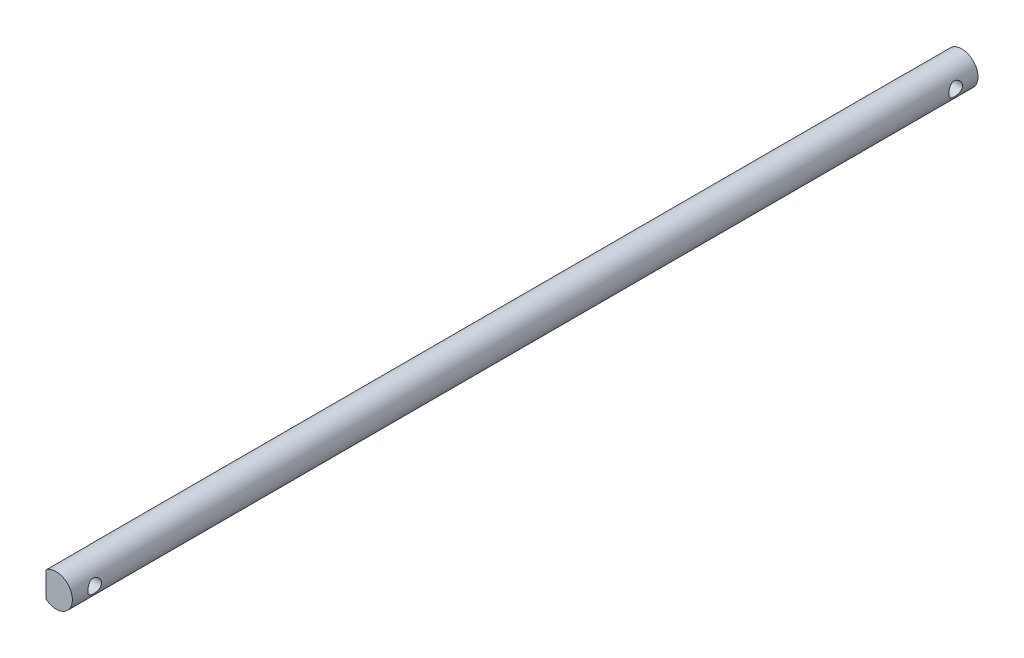
ISO-10303-21;
HEADER;
FILE_DESCRIPTION(('STEP AP214'),'2;1');
FILE_NAME('part.step','',(''),(''),'','','');
FILE_SCHEMA(('AUTOMOTIVE_DESIGN { 1 0 10303 214 1 1 1 1 }'));
ENDSEC;
DATA;
#1=APPLICATION_CONTEXT('core data for automotive mechanical design processes');
#2=APPLICATION_PROTOCOL_DEFINITION('international standard','automotive_design',2000,#1);
#3=PRODUCT_CONTEXT('',#1,'mechanical');
#4=PRODUCT('Part','Part','',(#3));
#5=PRODUCT_RELATED_PRODUCT_CATEGORY('part','',(#4));
#6=PRODUCT_DEFINITION_FORMATION('','',#4);
#7=PRODUCT_DEFINITION_CONTEXT('part definition',#1,'design');
#8=PRODUCT_DEFINITION('design','',#6,#7);
#9=PRODUCT_DEFINITION_SHAPE('','',#8);
#10=(LENGTH_UNIT() NAMED_UNIT(*) SI_UNIT(.MILLI.,.METRE.));
#11=(NAMED_UNIT(*) PLANE_ANGLE_UNIT() SI_UNIT($,.RADIAN.));
#12=(NAMED_UNIT(*) SI_UNIT($,.STERADIAN.) SOLID_ANGLE_UNIT());
#13=UNCERTAINTY_MEASURE_WITH_UNIT(LENGTH_MEASURE(1.E-05),#10,'distance_accuracy_value','');
#14=(GEOMETRIC_REPRESENTATION_CONTEXT(3) GLOBAL_UNCERTAINTY_ASSIGNED_CONTEXT((#13)) GLOBAL_UNIT_ASSIGNED_CONTEXT((#10,
#11,#12)) REPRESENTATION_CONTEXT('',''));
#15=CARTESIAN_POINT('',(0.,0.,0.));
#16=DIRECTION('',(0.,0.,1.));
#17=DIRECTION('',(1.,0.,0.));
#18=AXIS2_PLACEMENT_3D('',#15,#16,#17);
#19=CARTESIAN_POINT('',(0.,0.,223.));
#20=DIRECTION('',(0.,0.,-1.));
#21=DIRECTION('',(-1.,0.,0.));
#22=AXIS2_PLACEMENT_3D('',#19,#20,#21);
#23=CYLINDRICAL_SURFACE('',#22,4.);
#24=CARTESIAN_POINT('',(4.,0.,7.2));
#25=CARTESIAN_POINT('',(3.99999220597042,0.0909067383912381,7.19998971063012));
#26=CARTESIAN_POINT('',(3.99686535628648,0.181948247544874,7.19266521804974));
#27=CARTESIAN_POINT('',(3.98465863926745,0.361443817461364,7.16363113934321));
#28=CARTESIAN_POINT('',(3.9755635876372,0.449890675673103,7.14188485981159));
#29=CARTESIAN_POINT('',(3.95239600576765,0.621303418382834,7.08496241507771));
#30=CARTESIAN_POINT('',(3.93834062442321,0.704287032203662,7.04983248708134));
#31=CARTESIAN_POINT('',(3.90661303424537,0.863099993382736,6.9673347121455));
#32=CARTESIAN_POINT('',(3.88894184037472,0.938931339683004,6.91997029846346));
#33=CARTESIAN_POINT('',(3.85071852141569,1.08533887118012,6.81175952105815));
#34=CARTESIAN_POINT('',(3.83006960280207,1.15549620225715,6.75038097426594));
#35=CARTESIAN_POINT('',(3.78862734806511,1.28488425592701,6.61701067602155));
#36=CARTESIAN_POINT('',(3.76783393942688,1.34410900804107,6.54501316374258));
#37=CARTESIAN_POINT('',(3.72725158425048,1.45297914161398,6.38794326566456));
#38=CARTESIAN_POINT('',(3.70757005023861,1.50197144957215,6.30238752295881));
#39=CARTESIAN_POINT('',(3.67298326222159,1.58468252966002,6.12329379694671));
#40=CARTESIAN_POINT('',(3.6580754512366,1.6184094824862,6.02976012102782));
#41=CARTESIAN_POINT('',(3.63577599564205,1.66788510104617,5.84218741565488));
#42=CARTESIAN_POINT('',(3.62804858539708,1.68444164210522,5.74840297555926));
#43=CARTESIAN_POINT('',(3.62002384663305,1.70162480860733,5.55909337406137));
#44=CARTESIAN_POINT('',(3.61972217873622,1.70226073757513,5.46356926193557));
#45=CARTESIAN_POINT('',(3.62630002474142,1.68819130162689,5.28169277189617));
#46=CARTESIAN_POINT('',(3.63260434164112,1.6747147959927,5.19522027892165));
#47=CARTESIAN_POINT('',(3.65070840844882,1.63487058638113,5.02590579159212));
#48=CARTESIAN_POINT('',(3.66250926167832,1.60850029417696,4.94306452978975));
#49=CARTESIAN_POINT('',(3.69054609418258,1.5430988475594,4.78122918122404));
#50=CARTESIAN_POINT('',(3.70687264164878,1.50380571381535,4.70235736514182));
#51=CARTESIAN_POINT('',(3.74210223346658,1.41386001526362,4.55201188964113));
#52=CARTESIAN_POINT('',(3.76100631502547,1.36320287222268,4.48054122894492));
#53=CARTESIAN_POINT('',(3.80128969459956,1.2467214443949,4.34038696158588));
#54=CARTESIAN_POINT('',(3.82274019222962,1.179953093145,4.27250614615909));
#55=CARTESIAN_POINT('',(3.86429704947114,1.0357766835901,4.14862946088348));
#56=CARTESIAN_POINT('',(3.88440306762471,0.95836593757264,4.09263660242861));
#57=CARTESIAN_POINT('',(3.92163290268784,0.792578450005455,3.99288246943645));
#58=CARTESIAN_POINT('',(3.93867002040557,0.703976692649455,3.94946038866755));
#59=CARTESIAN_POINT('',(3.96717150105244,0.519816535420784,3.87842199833599));
#60=CARTESIAN_POINT('',(3.97863907098317,0.424262175462372,3.85079659126056));
#61=CARTESIAN_POINT('',(3.99410277532845,0.235607210966912,3.81384524072936));
#62=CARTESIAN_POINT('',(3.99853766037867,0.142753433781747,3.8034427183361));
#63=CARTESIAN_POINT('',(4.00084626519537,-0.0434719300977819,3.7980071221176));
#64=CARTESIAN_POINT('',(3.99872196660535,-0.136843351894629,3.8029694063182));
#65=CARTESIAN_POINT('',(3.9884337975937,-0.316328126109378,3.82736321655387));
#66=CARTESIAN_POINT('',(3.98059025078653,-0.402566216761333,3.84602767505951));
#67=CARTESIAN_POINT('',(3.96000012032105,-0.570585652286979,3.89621612770418));
#68=CARTESIAN_POINT('',(3.94725292362944,-0.652366438467558,3.92774172971809));
#69=CARTESIAN_POINT('',(3.91757618822361,-0.812034318548237,4.00378341019227));
#70=CARTESIAN_POINT('',(3.9005285877614,-0.889720370209443,4.04867404239986));
#71=CARTESIAN_POINT('',(3.86405536635233,-1.03673648824899,4.14976139854671));
#72=CARTESIAN_POINT('',(3.84462873775923,-1.10606298906366,4.20596291978486));
#73=CARTESIAN_POINT('',(3.80369998966484,-1.23980420956813,4.33294984842841));
#74=CARTESIAN_POINT('',(3.78215082847771,-1.30347271839269,4.40450798357526));
#75=CARTESIAN_POINT('',(3.74067716848582,-1.41811853281525,4.55761541018552));
#76=CARTESIAN_POINT('',(3.7207530965884,-1.46909251076311,4.63916731299962));
#77=CARTESIAN_POINT('',(3.6845994787195,-1.5575812751315,4.81188201646957));
#78=CARTESIAN_POINT('',(3.66843760396252,-1.59485563043623,4.90318323120828));
#79=CARTESIAN_POINT('',(3.64253466336686,-1.65317215153204,5.09167222227236));
#80=CARTESIAN_POINT('',(3.63278801447038,-1.6742284343492,5.18885479949513));
#81=CARTESIAN_POINT('',(3.62169510113298,-1.6980817865036,5.37803410037236));
#82=CARTESIAN_POINT('',(3.61974326789463,-1.70219594466855,5.4698298699793));
#83=CARTESIAN_POINT('',(3.62284103372561,-1.69559342985225,5.65275629480105));
#84=CARTESIAN_POINT('',(3.62788944867838,-1.68487926513445,5.74388705988267));
#85=CARTESIAN_POINT('',(3.64385594943718,-1.65004520545517,5.91815437757504));
#86=CARTESIAN_POINT('',(3.65446553868685,-1.62662781472624,6.00146238135394));
#87=CARTESIAN_POINT('',(3.68010476578384,-1.56775451171664,6.16297806592282));
#88=CARTESIAN_POINT('',(3.69513565573577,-1.5322951887417,6.24118429422305));
#89=CARTESIAN_POINT('',(3.72906792770947,-1.44784032686706,6.39552581251936));
#90=CARTESIAN_POINT('',(3.74815036482766,-1.39814701464036,6.47123869292639));
#91=CARTESIAN_POINT('',(3.78755219655615,-1.28759066878811,6.61366252775445));
#92=CARTESIAN_POINT('',(3.80787204550609,-1.22672351574411,6.68037014644764));
#93=CARTESIAN_POINT('',(3.84933921665509,-1.08998592064412,6.80818466399305));
#94=CARTESIAN_POINT('',(3.87042965397422,-1.01332080388047,6.86846394346638));
#95=CARTESIAN_POINT('',(3.90950085981833,-0.850192328366723,6.97535721845034));
#96=CARTESIAN_POINT('',(3.92748021606687,-0.763724549019843,7.021965014425));
#97=CARTESIAN_POINT('',(3.95807109121892,-0.584638322061836,7.09923982771681));
#98=CARTESIAN_POINT('',(3.97076006232551,-0.492133369486677,7.1301384218695));
#99=CARTESIAN_POINT('',(3.98965231477193,-0.302747237251515,7.17563911424574));
#100=CARTESIAN_POINT('',(3.99587575072494,-0.205880644982405,7.19029186429268));
#101=CARTESIAN_POINT('',(3.99951115527041,-0.0724124000644828,7.19884729181778));
#102=CARTESIAN_POINT('',(4.00000310511145,-0.0362168954062217,7.20000409924545));
#103=CARTESIAN_POINT('',(4.,0.,7.2));
#104=B_SPLINE_CURVE_WITH_KNOTS('',3,(#24,#25,#26,#27,#28,#29,#30,#31,#32,#33,#34,#35,#36,#37,
#38,#39,#40,#41,#42,#43,#44,#45,#46,#47,#48,#49,#50,#51,#52,#53,#54,#55,#56,#57,#58,#59,#60,#61,
#62,#63,#64,#65,#66,#67,#68,#69,#70,#71,#72,#73,#74,#75,#76,#77,#78,#79,#80,#81,#82,#83,#84,#85,
#86,#87,#88,#89,#90,#91,#92,#93,#94,#95,#96,#97,#98,#99,#100,#101,#102,#103),.UNSPECIFIED.,.T.,
.F.,(4,2,2,2,2,2,2,2,2,2,2,2,2,2,2,2,2,2,2,2,2,2,2,2,2,2,2,2,2,2,2,2,2,2,2,2,2,2,2,4),(0.,
0.272614080586948,0.545924448955114,0.818299036258466,1.0905972723283,1.37578897563167,
1.66113596945129,1.96122665765481,2.26115633643809,2.54622741570577,2.83113190415595,
3.09313885870026,3.35519842866463,3.62293686689447,3.89078336358892,4.18227106535257,
4.47383251736207,4.7726521256818,5.07129946606979,5.35045690028006,5.6295300044251,
5.89406804870765,6.15863917515647,6.43146346064616,6.70440370416334,6.99759736979759,
7.29086781033874,7.58906383735701,7.88700000529106,8.16127896953773,8.43551154419409,
8.69592961746398,8.95642151179744,9.23291696910161,9.5095145664191,9.80742506459498,
10.1054704465792,10.3989846098609,10.691581048933,10.80018945154),.UNSPECIFIED.);
#105=CARTESIAN_POINT('',(4.,0.,7.2));
#106=VERTEX_POINT('',#105);
#107=EDGE_CURVE('E11',#106,#106,#104,.T.);
#108=ORIENTED_EDGE('',*,*,#107,.T.);
#109=EDGE_LOOP('',(#108));
#110=FACE_BOUND('',#109,.T.);
#111=CARTESIAN_POINT('',(4.,0.,219.2));
#112=CARTESIAN_POINT('',(3.99999220597042,0.0909067383912384,219.19998971063));
#113=CARTESIAN_POINT('',(3.99686535628648,0.181948247544875,219.19266521805));
#114=CARTESIAN_POINT('',(3.98465863926745,0.361443817461365,219.163631139343));
#115=CARTESIAN_POINT('',(3.9755635876372,0.449890675673104,219.141884859812));
#116=CARTESIAN_POINT('',(3.95239600576765,0.621303418382839,219.084962415078));
#117=CARTESIAN_POINT('',(3.93834062442321,0.704287032203672,219.049832487081));
#118=CARTESIAN_POINT('',(3.90661303424537,0.863099993382748,218.967334712145));
#119=CARTESIAN_POINT('',(3.88894184037472,0.938931339683013,218.919970298463));
#120=CARTESIAN_POINT('',(3.85071852141569,1.08533887118013,218.811759521058));
#121=CARTESIAN_POINT('',(3.83006960280207,1.15549620225716,218.750380974266));
#122=CARTESIAN_POINT('',(3.78862734806511,1.28488425592702,218.617010676022));
#123=CARTESIAN_POINT('',(3.76783393942688,1.34410900804107,218.545013163743));
#124=CARTESIAN_POINT('',(3.72725158425048,1.45297914161399,218.387943265665));
#125=CARTESIAN_POINT('',(3.70757005023861,1.50197144957215,218.302387522959));
#126=CARTESIAN_POINT('',(3.67298326222159,1.58468252966003,218.123293796947));
#127=CARTESIAN_POINT('',(3.6580754512366,1.61840948248621,218.029760121028));
#128=CARTESIAN_POINT('',(3.63577599564205,1.66788510104617,217.842187415655));
#129=CARTESIAN_POINT('',(3.62804858539708,1.68444164210522,217.748402975559));
#130=CARTESIAN_POINT('',(3.62002384663305,1.70162480860734,217.559093374061));
#131=CARTESIAN_POINT('',(3.61972217873622,1.70226073757513,217.463569261936));
#132=CARTESIAN_POINT('',(3.62630002474142,1.6881913016269,217.281692771896));
#133=CARTESIAN_POINT('',(3.63260434164112,1.67471479599271,217.195220278922));
#134=CARTESIAN_POINT('',(3.65070840844882,1.63487058638114,217.025905791592));
#135=CARTESIAN_POINT('',(3.66250926167832,1.60850029417696,216.94306452979));
#136=CARTESIAN_POINT('',(3.69054609418257,1.5430988475594,216.781229181224));
#137=CARTESIAN_POINT('',(3.70687264164878,1.50380571381535,216.702357365142));
#138=CARTESIAN_POINT('',(3.74210223346658,1.41386001526363,216.552011889641));
#139=CARTESIAN_POINT('',(3.76100631502546,1.36320287222268,216.480541228945));
#140=CARTESIAN_POINT('',(3.80128969459956,1.2467214443949,216.340386961586));
#141=CARTESIAN_POINT('',(3.82274019222962,1.179953093145,216.272506146159));
#142=CARTESIAN_POINT('',(3.86429704947114,1.0357766835901,216.148629460883));
#143=CARTESIAN_POINT('',(3.88440306762471,0.958365937572633,216.092636602429));
#144=CARTESIAN_POINT('',(3.92163290268784,0.792578450005439,215.992882469436));
#145=CARTESIAN_POINT('',(3.93867002040557,0.70397669264944,215.949460388668));
#146=CARTESIAN_POINT('',(3.96717150105244,0.519816535420769,215.878421998336));
#147=CARTESIAN_POINT('',(3.97863907098317,0.424262175462356,215.850796591261));
#148=CARTESIAN_POINT('',(3.99410277532845,0.235607210966897,215.813845240729));
#149=CARTESIAN_POINT('',(3.99853766037867,0.142753433781734,215.803442718336));
#150=CARTESIAN_POINT('',(4.00084626519537,-0.0434719300977923,215.798007122118));
#151=CARTESIAN_POINT('',(3.99872196660535,-0.136843351894639,215.802969406318));
#152=CARTESIAN_POINT('',(3.9884337975937,-0.316328126109384,215.827363216554));
#153=CARTESIAN_POINT('',(3.98059025078653,-0.402566216761336,215.84602767506));
#154=CARTESIAN_POINT('',(3.96000012032105,-0.570585652286981,215.896216127704));
#155=CARTESIAN_POINT('',(3.94725292362944,-0.652366438467562,215.927741729718));
#156=CARTESIAN_POINT('',(3.91757618822361,-0.812034318548235,216.003783410192));
#157=CARTESIAN_POINT('',(3.9005285877614,-0.889720370209433,216.0486740424));
#158=CARTESIAN_POINT('',(3.86405536635233,-1.03673648824898,216.149761398547));
#159=CARTESIAN_POINT('',(3.84462873775923,-1.10606298906365,216.205962919785));
#160=CARTESIAN_POINT('',(3.80369998966485,-1.23980420956812,216.332949848428));
#161=CARTESIAN_POINT('',(3.78215082847772,-1.30347271839268,216.404507983575));
#162=CARTESIAN_POINT('',(3.74067716848582,-1.41811853281524,216.557615410185));
#163=CARTESIAN_POINT('',(3.7207530965884,-1.46909251076311,216.639167313));
#164=CARTESIAN_POINT('',(3.6845994787195,-1.5575812751315,216.81188201647));
#165=CARTESIAN_POINT('',(3.66843760396252,-1.59485563043623,216.903183231208));
#166=CARTESIAN_POINT('',(3.64253466336686,-1.65317215153204,217.091672222272));
#167=CARTESIAN_POINT('',(3.63278801447038,-1.6742284343492,217.188854799495));
#168=CARTESIAN_POINT('',(3.62169510113298,-1.6980817865036,217.378034100372));
#169=CARTESIAN_POINT('',(3.61974326789463,-1.70219594466856,217.469829869979));
#170=CARTESIAN_POINT('',(3.62284103372561,-1.69559342985225,217.652756294801));
#171=CARTESIAN_POINT('',(3.62788944867838,-1.68487926513445,217.743887059883));
#172=CARTESIAN_POINT('',(3.64385594943718,-1.65004520545517,217.918154377575));
#173=CARTESIAN_POINT('',(3.65446553868685,-1.62662781472624,218.001462381354));
#174=CARTESIAN_POINT('',(3.68010476578384,-1.56775451171664,218.162978065923));
#175=CARTESIAN_POINT('',(3.69513565573577,-1.53229518874171,218.241184294223));
#176=CARTESIAN_POINT('',(3.72906792770947,-1.44784032686706,218.395525812519));
#177=CARTESIAN_POINT('',(3.74815036482766,-1.39814701464036,218.471238692926));
#178=CARTESIAN_POINT('',(3.78755219655615,-1.28759066878811,218.613662527754));
#179=CARTESIAN_POINT('',(3.80787204550609,-1.2267235157441,218.680370146448));
#180=CARTESIAN_POINT('',(3.84933921665509,-1.08998592064411,218.808184663993));
#181=CARTESIAN_POINT('',(3.87042965397422,-1.01332080388046,218.868463943466));
#182=CARTESIAN_POINT('',(3.90950085981833,-0.850192328366721,218.97535721845));
#183=CARTESIAN_POINT('',(3.92748021606687,-0.763724549019845,219.021965014425));
#184=CARTESIAN_POINT('',(3.95807109121892,-0.58463832206184,219.099239827717));
#185=CARTESIAN_POINT('',(3.97076006232551,-0.492133369486678,219.130138421869));
#186=CARTESIAN_POINT('',(3.98965231477193,-0.302747237251513,219.175639114246));
#187=CARTESIAN_POINT('',(3.99587575072494,-0.205880644982404,219.190291864293));
#188=CARTESIAN_POINT('',(3.99951115527041,-0.0724124000644824,219.198847291818));
#189=CARTESIAN_POINT('',(4.00000310511145,-0.0362168954062215,219.200004099245));
#190=CARTESIAN_POINT('',(4.,0.,219.2));
#191=B_SPLINE_CURVE_WITH_KNOTS('',3,(#111,#112,#113,#114,#115,#116,#117,#118,#119,#120,#121,
#122,#123,#124,#125,#126,#127,#128,#129,#130,#131,#132,#133,#134,#135,#136,#137,#138,#139,#140,
#141,#142,#143,#144,#145,#146,#147,#148,#149,#150,#151,#152,#153,#154,#155,#156,#157,#158,#159,
#160,#161,#162,#163,#164,#165,#166,#167,#168,#169,#170,#171,#172,#173,#174,#175,#176,#177,#178,
#179,#180,#181,#182,#183,#184,#185,#186,#187,#188,#189,#190),.UNSPECIFIED.,.T.,.F.,(4,2,2,2,2,2,
2,2,2,2,2,2,2,2,2,2,2,2,2,2,2,2,2,2,2,2,2,2,2,2,2,2,2,2,2,2,2,2,2,4),(0.,0.27261408058695,
0.545924448955118,0.818299036258478,1.09059727232831,1.3757889756317,1.66113596945128,
1.9612266576548,2.2611563364381,2.54622741570571,2.83113190415595,3.09313885870021,
3.35519842866462,3.62293686689442,3.89078336358892,4.18227106535255,4.47383251736209,
4.77265212568181,5.07129946606979,5.35045690028007,5.6295300044251,5.89406804870764,
6.15863917515646,6.43146346064613,6.70440370416333,6.99759736979754,7.29086781033874,
7.58906383735698,7.88700000529105,8.16127896953776,8.43551154419409,8.69592961746396,
8.95642151179745,9.23291696910161,9.5095145664191,9.80742506459497,10.1054704465792,
10.3989846098609,10.691581048933,10.80018945154),.UNSPECIFIED.);
#192=CARTESIAN_POINT('',(4.,0.,219.2));
#193=VERTEX_POINT('',#192);
#194=EDGE_CURVE('E46',#193,#193,#191,.T.);
#195=ORIENTED_EDGE('',*,*,#194,.T.);
#196=EDGE_LOOP('',(#195));
#197=FACE_BOUND('',#196,.T.);
#198=CARTESIAN_POINT('',(0.,0.,11.));
#199=DIRECTION('',(0.,0.,1.));
#200=DIRECTION('',(1.,0.,0.));
#201=AXIS2_PLACEMENT_3D('',#198,#199,#200);
#202=CIRCLE('',#201,4.);
#203=CARTESIAN_POINT('',(-2.5,3.1224989991992,11.));
#204=VERTEX_POINT('',#203);
#205=CARTESIAN_POINT('',(-2.5,-3.1224989991992,11.));
#206=VERTEX_POINT('',#205);
#207=EDGE_CURVE('E87',#204,#206,#202,.T.);
#208=ORIENTED_EDGE('',*,*,#207,.T.);
#209=DIRECTION('',(0.,0.,-1.));
#210=VECTOR('',#209,1.);
#211=CARTESIAN_POINT('',(-2.5,-3.1224989991992,11.));
#212=LINE('',#211,#210);
#213=CARTESIAN_POINT('',(-2.5,-3.1224989991992,0.));
#214=VERTEX_POINT('',#213);
#215=EDGE_CURVE('E78',#206,#214,#212,.T.);
#216=ORIENTED_EDGE('',*,*,#215,.T.);
#217=CARTESIAN_POINT('',(0.,0.,0.));
#218=DIRECTION('',(0.,0.,1.));
#219=DIRECTION('',(1.,0.,0.));
#220=AXIS2_PLACEMENT_3D('',#217,#218,#219);
#221=CIRCLE('',#220,4.);
#222=CARTESIAN_POINT('',(-2.5,3.1224989991992,0.));
#223=VERTEX_POINT('',#222);
#224=EDGE_CURVE('E108',#214,#223,#221,.T.);
#225=ORIENTED_EDGE('',*,*,#224,.T.);
#226=DIRECTION('',(0.,0.,-1.));
#227=VECTOR('',#226,1.);
#228=CARTESIAN_POINT('',(-2.5,3.1224989991992,11.));
#229=LINE('',#228,#227);
#230=EDGE_CURVE('E53',#204,#223,#229,.T.);
#231=ORIENTED_EDGE('',*,*,#230,.F.);
#232=EDGE_LOOP('',(#208,#216,#225,#231));
#233=FACE_BOUND('',#232,.T.);
#234=DIRECTION('',(0.,0.,1.));
#235=VECTOR('',#234,1.);
#236=CARTESIAN_POINT('',(-2.5,3.1224989991992,212.));
#237=LINE('',#236,#235);
#238=CARTESIAN_POINT('',(-2.5,3.1224989991992,212.));
#239=VERTEX_POINT('',#238);
#240=CARTESIAN_POINT('',(-2.5,3.1224989991992,223.));
#241=VERTEX_POINT('',#240);
#242=EDGE_CURVE('E105',#239,#241,#237,.T.);
#243=ORIENTED_EDGE('',*,*,#242,.T.);
#244=CARTESIAN_POINT('',(0.,0.,223.));
#245=DIRECTION('',(0.,0.,1.));
#246=DIRECTION('',(1.,0.,0.));
#247=AXIS2_PLACEMENT_3D('',#244,#245,#246);
#248=CIRCLE('',#247,4.);
#249=CARTESIAN_POINT('',(-2.5,-3.1224989991992,223.));
#250=VERTEX_POINT('',#249);
#251=EDGE_CURVE('E111',#250,#241,#248,.T.);
#252=ORIENTED_EDGE('',*,*,#251,.F.);
#253=DIRECTION('',(0.,0.,1.));
#254=VECTOR('',#253,1.);
#255=CARTESIAN_POINT('',(-2.5,-3.1224989991992,212.));
#256=LINE('',#255,#254);
#257=CARTESIAN_POINT('',(-2.5,-3.1224989991992,212.));
#258=VERTEX_POINT('',#257);
#259=EDGE_CURVE('E61',#258,#250,#256,.T.);
#260=ORIENTED_EDGE('',*,*,#259,.F.);
#261=CARTESIAN_POINT('',(0.,0.,212.));
#262=DIRECTION('',(0.,0.,1.));
#263=DIRECTION('',(1.,0.,0.));
#264=AXIS2_PLACEMENT_3D('',#261,#262,#263);
#265=CIRCLE('',#264,4.);
#266=EDGE_CURVE('E102',#239,#258,#265,.T.);
#267=ORIENTED_EDGE('',*,*,#266,.F.);
#268=EDGE_LOOP('',(#243,#252,#260,#267));
#269=FACE_BOUND('',#268,.T.);
#270=ADVANCED_FACE('F34',(#110,#197,#233,#269),#23,.T.);
#271=CARTESIAN_POINT('',(0.,0.,223.));
#272=DIRECTION('',(0.,0.,1.));
#273=DIRECTION('',(1.,0.,0.));
#274=AXIS2_PLACEMENT_3D('',#271,#272,#273);
#275=PLANE('',#274);
#276=ORIENTED_EDGE('',*,*,#251,.T.);
#277=DIRECTION('',(0.,-1.,0.));
#278=VECTOR('',#277,1.);
#279=CARTESIAN_POINT('',(-2.5,0.,223.));
#280=LINE('',#279,#278);
#281=EDGE_CURVE('E98',#241,#250,#280,.T.);
#282=ORIENTED_EDGE('',*,*,#281,.T.);
#283=EDGE_LOOP('',(#276,#282));
#284=FACE_BOUND('',#283,.T.);
#285=ADVANCED_FACE('F140',(#284),#275,.T.);
#286=CARTESIAN_POINT('',(0.,0.,0.));
#287=DIRECTION('',(0.,0.,1.));
#288=DIRECTION('',(1.,0.,0.));
#289=AXIS2_PLACEMENT_3D('',#286,#287,#288);
#290=PLANE('',#289);
#291=ORIENTED_EDGE('',*,*,#224,.F.);
#292=DIRECTION('',(0.,-1.,0.));
#293=VECTOR('',#292,1.);
#294=CARTESIAN_POINT('',(-2.5,0.,0.));
#295=LINE('',#294,#293);
#296=EDGE_CURVE('E82',#223,#214,#295,.T.);
#297=ORIENTED_EDGE('',*,*,#296,.F.);
#298=EDGE_LOOP('',(#291,#297));
#299=FACE_BOUND('',#298,.T.);
#300=ADVANCED_FACE('F138',(#299),#290,.F.);
#301=CARTESIAN_POINT('',(-2.5,0.,212.));
#302=DIRECTION('',(-1.,0.,0.));
#303=DIRECTION('',(0.,0.,1.));
#304=AXIS2_PLACEMENT_3D('',#301,#302,#303);
#305=PLANE('',#304);
#306=CARTESIAN_POINT('',(-2.5,0.,217.5));
#307=DIRECTION('',(-1.,0.,0.));
#308=DIRECTION('',(0.,0.,1.));
#309=AXIS2_PLACEMENT_3D('',#306,#307,#308);
#310=CIRCLE('',#309,1.7);
#311=CARTESIAN_POINT('',(-2.5,0.,219.2));
#312=VERTEX_POINT('',#311);
#313=EDGE_CURVE('E97',#312,#312,#310,.T.);
#314=ORIENTED_EDGE('',*,*,#313,.F.);
#315=EDGE_LOOP('',(#314));
#316=FACE_BOUND('',#315,.T.);
#317=ORIENTED_EDGE('',*,*,#281,.F.);
#318=ORIENTED_EDGE('',*,*,#242,.F.);
#319=DIRECTION('',(0.,-1.,0.));
#320=VECTOR('',#319,1.);
#321=CARTESIAN_POINT('',(-2.5,0.,212.));
#322=LINE('',#321,#320);
#323=EDGE_CURVE('E100',#239,#258,#322,.T.);
#324=ORIENTED_EDGE('',*,*,#323,.T.);
#325=ORIENTED_EDGE('',*,*,#259,.T.);
#326=EDGE_LOOP('',(#317,#318,#324,#325));
#327=FACE_BOUND('',#326,.T.);
#328=ADVANCED_FACE('F134',(#316,#327),#305,.T.);
#329=CARTESIAN_POINT('',(0.,0.,212.));
#330=DIRECTION('',(0.,0.,1.));
#331=DIRECTION('',(1.,0.,0.));
#332=AXIS2_PLACEMENT_3D('',#329,#330,#331);
#333=PLANE('',#332);
#334=ORIENTED_EDGE('',*,*,#323,.F.);
#335=ORIENTED_EDGE('',*,*,#266,.T.);
#336=EDGE_LOOP('',(#334,#335));
#337=FACE_BOUND('',#336,.T.);
#338=ADVANCED_FACE('F130',(#337),#333,.T.);
#339=CARTESIAN_POINT('',(-2.5,0.,11.));
#340=DIRECTION('',(1.,0.,0.));
#341=DIRECTION('',(0.,0.,-1.));
#342=AXIS2_PLACEMENT_3D('',#339,#340,#341);
#343=PLANE('',#342);
#344=CARTESIAN_POINT('',(-2.5,0.,5.50000000000001));
#345=DIRECTION('',(-1.,0.,0.));
#346=DIRECTION('',(0.,0.,1.));
#347=AXIS2_PLACEMENT_3D('',#344,#345,#346);
#348=CIRCLE('',#347,1.7);
#349=CARTESIAN_POINT('',(-2.5,0.,7.2));
#350=VERTEX_POINT('',#349);
#351=EDGE_CURVE('E162',#350,#350,#348,.T.);
#352=ORIENTED_EDGE('',*,*,#351,.F.);
#353=EDGE_LOOP('',(#352));
#354=FACE_BOUND('',#353,.T.);
#355=ORIENTED_EDGE('',*,*,#296,.T.);
#356=ORIENTED_EDGE('',*,*,#215,.F.);
#357=DIRECTION('',(0.,-1.,0.));
#358=VECTOR('',#357,1.);
#359=CARTESIAN_POINT('',(-2.5,0.,11.));
#360=LINE('',#359,#358);
#361=EDGE_CURVE('E81',#204,#206,#360,.T.);
#362=ORIENTED_EDGE('',*,*,#361,.F.);
#363=ORIENTED_EDGE('',*,*,#230,.T.);
#364=EDGE_LOOP('',(#355,#356,#362,#363));
#365=FACE_BOUND('',#364,.T.);
#366=ADVANCED_FACE('F80',(#354,#365),#343,.F.);
#367=CARTESIAN_POINT('',(0.,0.,11.));
#368=DIRECTION('',(0.,0.,-1.));
#369=DIRECTION('',(1.,0.,0.));
#370=AXIS2_PLACEMENT_3D('',#367,#368,#369);
#371=PLANE('',#370);
#372=ORIENTED_EDGE('',*,*,#361,.T.);
#373=ORIENTED_EDGE('',*,*,#207,.F.);
#374=EDGE_LOOP('',(#372,#373));
#375=FACE_BOUND('',#374,.T.);
#376=ADVANCED_FACE('F90',(#375),#371,.T.);
#377=CARTESIAN_POINT('',(-2.5,0.,217.5));
#378=DIRECTION('',(-1.,0.,0.));
#379=DIRECTION('',(0.,0.,1.));
#380=AXIS2_PLACEMENT_3D('',#377,#378,#379);
#381=CYLINDRICAL_SURFACE('',#380,1.7);
#382=ORIENTED_EDGE('',*,*,#313,.T.);
#383=EDGE_LOOP('',(#382));
#384=FACE_BOUND('',#383,.T.);
#385=ORIENTED_EDGE('',*,*,#194,.F.);
#386=EDGE_LOOP('',(#385));
#387=FACE_BOUND('',#386,.T.);
#388=ADVANCED_FACE('F119',(#384,#387),#381,.F.);
#389=CARTESIAN_POINT('',(-2.5,0.,5.50000000000001));
#390=DIRECTION('',(-1.,0.,0.));
#391=DIRECTION('',(0.,0.,1.));
#392=AXIS2_PLACEMENT_3D('',#389,#390,#391);
#393=CYLINDRICAL_SURFACE('',#392,1.7);
#394=ORIENTED_EDGE('',*,*,#351,.T.);
#395=EDGE_LOOP('',(#394));
#396=FACE_BOUND('',#395,.T.);
#397=ORIENTED_EDGE('',*,*,#107,.F.);
#398=EDGE_LOOP('',(#397));
#399=FACE_BOUND('',#398,.T.);
#400=ADVANCED_FACE('F123',(#396,#399),#393,.F.);
#401=CLOSED_SHELL('',(#270,#285,#300,#328,#338,#366,#376,#388,#400));
#402=MANIFOLD_SOLID_BREP('B2',#401);
#403=ADVANCED_BREP_SHAPE_REPRESENTATION('',(#18,#402),#14);
#404=SHAPE_DEFINITION_REPRESENTATION(#9,#403);
ENDSEC;
END-ISO-10303-21;
